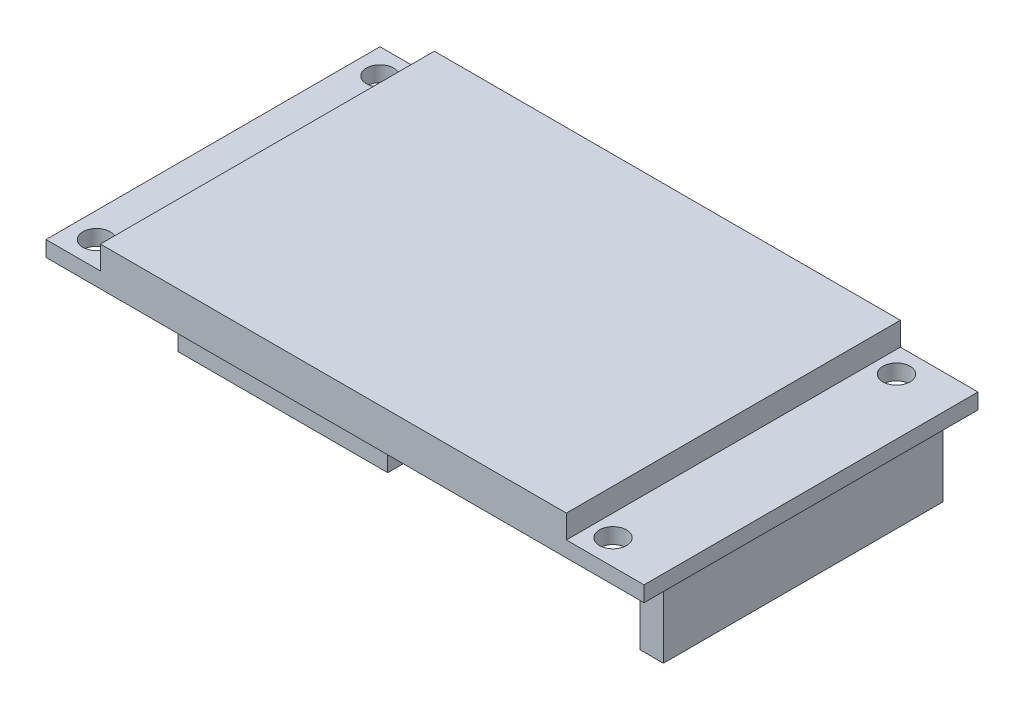
ISO-10303-21;
HEADER;
FILE_DESCRIPTION(('STEP AP214'),'2;1');
FILE_NAME('part.step','',(''),(''),'','','');
FILE_SCHEMA(('AUTOMOTIVE_DESIGN { 1 0 10303 214 1 1 1 1 }'));
ENDSEC;
DATA;
#1=APPLICATION_CONTEXT('core data for automotive mechanical design processes');
#2=APPLICATION_PROTOCOL_DEFINITION('international standard','automotive_design',2000,#1);
#3=PRODUCT_CONTEXT('',#1,'mechanical');
#4=PRODUCT('Part','Part','',(#3));
#5=PRODUCT_RELATED_PRODUCT_CATEGORY('part','',(#4));
#6=PRODUCT_DEFINITION_FORMATION('','',#4);
#7=PRODUCT_DEFINITION_CONTEXT('part definition',#1,'design');
#8=PRODUCT_DEFINITION('design','',#6,#7);
#9=PRODUCT_DEFINITION_SHAPE('','',#8);
#10=(LENGTH_UNIT() NAMED_UNIT(*) SI_UNIT(.MILLI.,.METRE.));
#11=(NAMED_UNIT(*) PLANE_ANGLE_UNIT() SI_UNIT($,.RADIAN.));
#12=(NAMED_UNIT(*) SI_UNIT($,.STERADIAN.) SOLID_ANGLE_UNIT());
#13=UNCERTAINTY_MEASURE_WITH_UNIT(LENGTH_MEASURE(1.E-05),#10,'distance_accuracy_value','');
#14=(GEOMETRIC_REPRESENTATION_CONTEXT(3) GLOBAL_UNCERTAINTY_ASSIGNED_CONTEXT((#13)) GLOBAL_UNIT_ASSIGNED_CONTEXT((#10,
#11,#12)) REPRESENTATION_CONTEXT('',''));
#15=CARTESIAN_POINT('',(0.,0.,0.));
#16=DIRECTION('',(0.,0.,1.));
#17=DIRECTION('',(1.,0.,0.));
#18=AXIS2_PLACEMENT_3D('',#15,#16,#17);
#19=CARTESIAN_POINT('',(0.,0.,0.));
#20=DIRECTION('',(0.,1.,0.));
#21=DIRECTION('',(0.,0.,1.));
#22=AXIS2_PLACEMENT_3D('',#19,#20,#21);
#23=PLANE('',#22);
#24=DIRECTION('',(0.,0.,1.));
#25=VECTOR('',#24,1.);
#26=CARTESIAN_POINT('',(37.5,0.,18.));
#27=LINE('',#26,#25);
#28=CARTESIAN_POINT('',(37.5,0.,-18.));
#29=VERTEX_POINT('',#28);
#30=CARTESIAN_POINT('',(37.5,0.,18.));
#31=VERTEX_POINT('',#30);
#32=EDGE_CURVE('E173',#29,#31,#27,.T.);
#33=ORIENTED_EDGE('',*,*,#32,.F.);
#34=DIRECTION('',(1.,0.,0.));
#35=VECTOR('',#34,1.);
#36=CARTESIAN_POINT('',(34.5,0.,-18.));
#37=LINE('',#36,#35);
#38=CARTESIAN_POINT('',(34.5,0.,-18.));
#39=VERTEX_POINT('',#38);
#40=EDGE_CURVE('E186',#39,#29,#37,.T.);
#41=ORIENTED_EDGE('',*,*,#40,.F.);
#42=DIRECTION('',(0.,0.,-1.));
#43=VECTOR('',#42,1.);
#44=CARTESIAN_POINT('',(34.5,0.,18.));
#45=LINE('',#44,#43);
#46=CARTESIAN_POINT('',(34.5,0.,18.));
#47=VERTEX_POINT('',#46);
#48=EDGE_CURVE('E195',#47,#39,#45,.T.);
#49=ORIENTED_EDGE('',*,*,#48,.F.);
#50=DIRECTION('',(-1.,0.,0.));
#51=VECTOR('',#50,1.);
#52=CARTESIAN_POINT('',(34.5,0.,18.));
#53=LINE('',#52,#51);
#54=EDGE_CURVE('E176',#31,#47,#53,.T.);
#55=ORIENTED_EDGE('',*,*,#54,.F.);
#56=EDGE_LOOP('',(#33,#41,#49,#55));
#57=FACE_BOUND('',#56,.T.);
#58=CARTESIAN_POINT('',(-35.25,0.,18.25));
#59=DIRECTION('',(0.,1.,0.));
#60=DIRECTION('',(0.,0.,1.));
#61=AXIS2_PLACEMENT_3D('',#58,#59,#60);
#62=CIRCLE('',#61,1.75);
#63=CARTESIAN_POINT('',(-35.25,0.,20.));
#64=VERTEX_POINT('',#63);
#65=EDGE_CURVE('E212',#64,#64,#62,.T.);
#66=ORIENTED_EDGE('',*,*,#65,.T.);
#67=EDGE_LOOP('',(#66));
#68=FACE_BOUND('',#67,.T.);
#69=CARTESIAN_POINT('',(-35.25,0.,-18.25));
#70=DIRECTION('',(0.,1.,0.));
#71=DIRECTION('',(0.,0.,1.));
#72=AXIS2_PLACEMENT_3D('',#69,#70,#71);
#73=CIRCLE('',#72,1.75);
#74=CARTESIAN_POINT('',(-35.25,0.,-16.5));
#75=VERTEX_POINT('',#74);
#76=EDGE_CURVE('E218',#75,#75,#73,.T.);
#77=ORIENTED_EDGE('',*,*,#76,.T.);
#78=EDGE_LOOP('',(#77));
#79=FACE_BOUND('',#78,.T.);
#80=CARTESIAN_POINT('',(31.25,0.,18.25));
#81=DIRECTION('',(0.,1.,0.));
#82=DIRECTION('',(0.,0.,1.));
#83=AXIS2_PLACEMENT_3D('',#80,#81,#82);
#84=CIRCLE('',#83,1.75);
#85=CARTESIAN_POINT('',(31.25,0.,20.));
#86=VERTEX_POINT('',#85);
#87=EDGE_CURVE('E224',#86,#86,#84,.T.);
#88=ORIENTED_EDGE('',*,*,#87,.T.);
#89=EDGE_LOOP('',(#88));
#90=FACE_BOUND('',#89,.T.);
#91=CARTESIAN_POINT('',(31.25,0.,-18.25));
#92=DIRECTION('',(0.,1.,0.));
#93=DIRECTION('',(0.,0.,1.));
#94=AXIS2_PLACEMENT_3D('',#91,#92,#93);
#95=CIRCLE('',#94,1.75);
#96=CARTESIAN_POINT('',(31.25,0.,-16.5));
#97=VERTEX_POINT('',#96);
#98=EDGE_CURVE('E230',#97,#97,#95,.T.);
#99=ORIENTED_EDGE('',*,*,#98,.T.);
#100=EDGE_LOOP('',(#99));
#101=FACE_BOUND('',#100,.T.);
#102=DIRECTION('',(1.,0.,0.));
#103=VECTOR('',#102,1.);
#104=CARTESIAN_POINT('',(0.,0.,-21.5));
#105=LINE('',#104,#103);
#106=CARTESIAN_POINT('',(-38.5,0.,-21.5));
#107=VERTEX_POINT('',#106);
#108=CARTESIAN_POINT('',(38.5,0.,-21.5));
#109=VERTEX_POINT('',#108);
#110=EDGE_CURVE('E315',#107,#109,#105,.T.);
#111=ORIENTED_EDGE('',*,*,#110,.T.);
#112=DIRECTION('',(0.,0.,1.));
#113=VECTOR('',#112,1.);
#114=CARTESIAN_POINT('',(38.5,0.,0.));
#115=LINE('',#114,#113);
#116=CARTESIAN_POINT('',(38.5,0.,21.5));
#117=VERTEX_POINT('',#116);
#118=EDGE_CURVE('E307',#109,#117,#115,.T.);
#119=ORIENTED_EDGE('',*,*,#118,.T.);
#120=DIRECTION('',(1.,0.,0.));
#121=VECTOR('',#120,1.);
#122=CARTESIAN_POINT('',(0.,0.,21.5));
#123=LINE('',#122,#121);
#124=CARTESIAN_POINT('',(-38.5,0.,21.5));
#125=VERTEX_POINT('',#124);
#126=EDGE_CURVE('E320',#125,#117,#123,.T.);
#127=ORIENTED_EDGE('',*,*,#126,.F.);
#128=DIRECTION('',(0.,0.,1.));
#129=VECTOR('',#128,1.);
#130=CARTESIAN_POINT('',(-38.5,0.,0.));
#131=LINE('',#130,#129);
#132=EDGE_CURVE('E233',#107,#125,#131,.T.);
#133=ORIENTED_EDGE('',*,*,#132,.F.);
#134=EDGE_LOOP('',(#111,#119,#127,#133));
#135=FACE_BOUND('',#134,.T.);
#136=DIRECTION('',(0.,0.,1.));
#137=VECTOR('',#136,1.);
#138=CARTESIAN_POINT('',(4.49999999999999,0.,20.5));
#139=LINE('',#138,#137);
#140=CARTESIAN_POINT('',(4.49999999999999,0.,2.5));
#141=VERTEX_POINT('',#140);
#142=CARTESIAN_POINT('',(4.49999999999999,0.,20.5));
#143=VERTEX_POINT('',#142);
#144=EDGE_CURVE('E172',#141,#143,#139,.T.);
#145=ORIENTED_EDGE('',*,*,#144,.F.);
#146=DIRECTION('',(1.,0.,0.));
#147=VECTOR('',#146,1.);
#148=CARTESIAN_POINT('',(-22.5,0.,2.5));
#149=LINE('',#148,#147);
#150=CARTESIAN_POINT('',(-22.5,0.,2.5));
#151=VERTEX_POINT('',#150);
#152=EDGE_CURVE('E169',#151,#141,#149,.T.);
#153=ORIENTED_EDGE('',*,*,#152,.F.);
#154=DIRECTION('',(0.,0.,-1.));
#155=VECTOR('',#154,1.);
#156=CARTESIAN_POINT('',(-22.5,0.,20.5));
#157=LINE('',#156,#155);
#158=CARTESIAN_POINT('',(-22.5,0.,20.5));
#159=VERTEX_POINT('',#158);
#160=EDGE_CURVE('E59',#159,#151,#157,.T.);
#161=ORIENTED_EDGE('',*,*,#160,.F.);
#162=DIRECTION('',(-1.,0.,0.));
#163=VECTOR('',#162,1.);
#164=CARTESIAN_POINT('',(-22.5,0.,20.5));
#165=LINE('',#164,#163);
#166=EDGE_CURVE('E54',#143,#159,#165,.T.);
#167=ORIENTED_EDGE('',*,*,#166,.F.);
#168=EDGE_LOOP('',(#145,#153,#161,#167));
#169=FACE_BOUND('',#168,.T.);
#170=ADVANCED_FACE('F37',(#57,#68,#79,#90,#101,#135,#169),#23,.F.);
#171=CARTESIAN_POINT('',(28.5,5.,0.));
#172=DIRECTION('',(1.,0.,0.));
#173=DIRECTION('',(0.,0.,-1.));
#174=AXIS2_PLACEMENT_3D('',#171,#172,#173);
#175=PLANE('',#174);
#176=DIRECTION('',(0.,0.,1.));
#177=VECTOR('',#176,1.);
#178=CARTESIAN_POINT('',(28.5,2.,0.));
#179=LINE('',#178,#177);
#180=CARTESIAN_POINT('',(28.5,2.,-21.5));
#181=VERTEX_POINT('',#180);
#182=CARTESIAN_POINT('',(28.5,2.,21.5));
#183=VERTEX_POINT('',#182);
#184=EDGE_CURVE('E293',#181,#183,#179,.T.);
#185=ORIENTED_EDGE('',*,*,#184,.F.);
#186=DIRECTION('',(0.,-1.,0.));
#187=VECTOR('',#186,1.);
#188=CARTESIAN_POINT('',(28.5,5.,-21.5));
#189=LINE('',#188,#187);
#190=CARTESIAN_POINT('',(28.5,5.,-21.5));
#191=VERTEX_POINT('',#190);
#192=EDGE_CURVE('E11',#191,#181,#189,.T.);
#193=ORIENTED_EDGE('',*,*,#192,.F.);
#194=DIRECTION('',(0.,0.,1.));
#195=VECTOR('',#194,1.);
#196=CARTESIAN_POINT('',(28.5,5.,0.));
#197=LINE('',#196,#195);
#198=CARTESIAN_POINT('',(28.5,5.,21.5));
#199=VERTEX_POINT('',#198);
#200=EDGE_CURVE('E316',#191,#199,#197,.T.);
#201=ORIENTED_EDGE('',*,*,#200,.T.);
#202=DIRECTION('',(0.,-1.,0.));
#203=VECTOR('',#202,1.);
#204=CARTESIAN_POINT('',(28.5,5.,21.5));
#205=LINE('',#204,#203);
#206=EDGE_CURVE('E279',#199,#183,#205,.T.);
#207=ORIENTED_EDGE('',*,*,#206,.T.);
#208=EDGE_LOOP('',(#185,#193,#201,#207));
#209=FACE_BOUND('',#208,.T.);
#210=ADVANCED_FACE('F39',(#209),#175,.T.);
#211=CARTESIAN_POINT('',(0.,5.,-21.5));
#212=DIRECTION('',(0.,0.,-1.));
#213=DIRECTION('',(-1.,0.,0.));
#214=AXIS2_PLACEMENT_3D('',#211,#212,#213);
#215=PLANE('',#214);
#216=ORIENTED_EDGE('',*,*,#110,.F.);
#217=DIRECTION('',(0.,-1.,0.));
#218=VECTOR('',#217,1.);
#219=CARTESIAN_POINT('',(-38.5,2.,-21.5));
#220=LINE('',#219,#218);
#221=CARTESIAN_POINT('',(-38.5,2.,-21.5));
#222=VERTEX_POINT('',#221);
#223=EDGE_CURVE('E268',#222,#107,#220,.T.);
#224=ORIENTED_EDGE('',*,*,#223,.F.);
#225=DIRECTION('',(1.,0.,0.));
#226=VECTOR('',#225,1.);
#227=CARTESIAN_POINT('',(0.,2.,-21.5));
#228=LINE('',#227,#226);
#229=CARTESIAN_POINT('',(-31.5,2.,-21.5));
#230=VERTEX_POINT('',#229);
#231=EDGE_CURVE('E245',#222,#230,#228,.T.);
#232=ORIENTED_EDGE('',*,*,#231,.T.);
#233=DIRECTION('',(0.,-1.,0.));
#234=VECTOR('',#233,1.);
#235=CARTESIAN_POINT('',(-31.5,5.,-21.5));
#236=LINE('',#235,#234);
#237=CARTESIAN_POINT('',(-31.5,5.,-21.5));
#238=VERTEX_POINT('',#237);
#239=EDGE_CURVE('E46',#238,#230,#236,.T.);
#240=ORIENTED_EDGE('',*,*,#239,.F.);
#241=DIRECTION('',(1.,0.,0.));
#242=VECTOR('',#241,1.);
#243=CARTESIAN_POINT('',(0.,5.,-21.5));
#244=LINE('',#243,#242);
#245=EDGE_CURVE('E319',#238,#191,#244,.T.);
#246=ORIENTED_EDGE('',*,*,#245,.T.);
#247=ORIENTED_EDGE('',*,*,#192,.T.);
#248=DIRECTION('',(1.,0.,0.));
#249=VECTOR('',#248,1.);
#250=CARTESIAN_POINT('',(0.,2.,-21.5));
#251=LINE('',#250,#249);
#252=CARTESIAN_POINT('',(38.5,2.,-21.5));
#253=VERTEX_POINT('',#252);
#254=EDGE_CURVE('E298',#181,#253,#251,.T.);
#255=ORIENTED_EDGE('',*,*,#254,.T.);
#256=DIRECTION('',(0.,-1.,0.));
#257=VECTOR('',#256,1.);
#258=CARTESIAN_POINT('',(38.5,2.,-21.5));
#259=LINE('',#258,#257);
#260=EDGE_CURVE('E306',#253,#109,#259,.T.);
#261=ORIENTED_EDGE('',*,*,#260,.T.);
#262=EDGE_LOOP('',(#216,#224,#232,#240,#246,#247,#255,#261));
#263=FACE_BOUND('',#262,.T.);
#264=ADVANCED_FACE('F334',(#263),#215,.T.);
#265=CARTESIAN_POINT('',(-31.5,5.,0.));
#266=DIRECTION('',(1.,0.,0.));
#267=DIRECTION('',(0.,0.,-1.));
#268=AXIS2_PLACEMENT_3D('',#265,#266,#267);
#269=PLANE('',#268);
#270=ORIENTED_EDGE('',*,*,#239,.T.);
#271=DIRECTION('',(0.,0.,1.));
#272=VECTOR('',#271,1.);
#273=CARTESIAN_POINT('',(-31.5,2.,0.));
#274=LINE('',#273,#272);
#275=CARTESIAN_POINT('',(-31.5,2.,21.5));
#276=VERTEX_POINT('',#275);
#277=EDGE_CURVE('E241',#230,#276,#274,.T.);
#278=ORIENTED_EDGE('',*,*,#277,.T.);
#279=DIRECTION('',(0.,-1.,0.));
#280=VECTOR('',#279,1.);
#281=CARTESIAN_POINT('',(-31.5,5.,21.5));
#282=LINE('',#281,#280);
#283=CARTESIAN_POINT('',(-31.5,5.,21.5));
#284=VERTEX_POINT('',#283);
#285=EDGE_CURVE('E274',#284,#276,#282,.T.);
#286=ORIENTED_EDGE('',*,*,#285,.F.);
#287=DIRECTION('',(0.,0.,1.));
#288=VECTOR('',#287,1.);
#289=CARTESIAN_POINT('',(-31.5,5.,0.));
#290=LINE('',#289,#288);
#291=EDGE_CURVE('E323',#238,#284,#290,.T.);
#292=ORIENTED_EDGE('',*,*,#291,.F.);
#293=EDGE_LOOP('',(#270,#278,#286,#292));
#294=FACE_BOUND('',#293,.T.);
#295=ADVANCED_FACE('F343',(#294),#269,.F.);
#296=CARTESIAN_POINT('',(0.,5.,21.5));
#297=DIRECTION('',(0.,0.,-1.));
#298=DIRECTION('',(-1.,0.,0.));
#299=AXIS2_PLACEMENT_3D('',#296,#297,#298);
#300=PLANE('',#299);
#301=ORIENTED_EDGE('',*,*,#126,.T.);
#302=DIRECTION('',(0.,-1.,0.));
#303=VECTOR('',#302,1.);
#304=CARTESIAN_POINT('',(38.5,2.,21.5));
#305=LINE('',#304,#303);
#306=CARTESIAN_POINT('',(38.5,2.,21.5));
#307=VERTEX_POINT('',#306);
#308=EDGE_CURVE('E312',#307,#117,#305,.T.);
#309=ORIENTED_EDGE('',*,*,#308,.F.);
#310=DIRECTION('',(1.,0.,0.));
#311=VECTOR('',#310,1.);
#312=CARTESIAN_POINT('',(0.,2.,21.5));
#313=LINE('',#312,#311);
#314=EDGE_CURVE('E297',#183,#307,#313,.T.);
#315=ORIENTED_EDGE('',*,*,#314,.F.);
#316=ORIENTED_EDGE('',*,*,#206,.F.);
#317=DIRECTION('',(1.,0.,0.));
#318=VECTOR('',#317,1.);
#319=CARTESIAN_POINT('',(0.,5.,21.5));
#320=LINE('',#319,#318);
#321=EDGE_CURVE('E276',#284,#199,#320,.T.);
#322=ORIENTED_EDGE('',*,*,#321,.F.);
#323=ORIENTED_EDGE('',*,*,#285,.T.);
#324=DIRECTION('',(1.,0.,0.));
#325=VECTOR('',#324,1.);
#326=CARTESIAN_POINT('',(0.,2.,21.5));
#327=LINE('',#326,#325);
#328=CARTESIAN_POINT('',(-38.5,2.,21.5));
#329=VERTEX_POINT('',#328);
#330=EDGE_CURVE('E248',#329,#276,#327,.T.);
#331=ORIENTED_EDGE('',*,*,#330,.F.);
#332=DIRECTION('',(0.,-1.,0.));
#333=VECTOR('',#332,1.);
#334=CARTESIAN_POINT('',(-38.5,2.,21.5));
#335=LINE('',#334,#333);
#336=EDGE_CURVE('E250',#329,#125,#335,.T.);
#337=ORIENTED_EDGE('',*,*,#336,.T.);
#338=EDGE_LOOP('',(#301,#309,#315,#316,#322,#323,#331,#337));
#339=FACE_BOUND('',#338,.T.);
#340=ADVANCED_FACE('F271',(#339),#300,.F.);
#341=CARTESIAN_POINT('',(0.,5.,0.));
#342=DIRECTION('',(0.,1.,0.));
#343=DIRECTION('',(0.,0.,1.));
#344=AXIS2_PLACEMENT_3D('',#341,#342,#343);
#345=PLANE('',#344);
#346=ORIENTED_EDGE('',*,*,#200,.F.);
#347=ORIENTED_EDGE('',*,*,#245,.F.);
#348=ORIENTED_EDGE('',*,*,#291,.T.);
#349=ORIENTED_EDGE('',*,*,#321,.T.);
#350=EDGE_LOOP('',(#346,#347,#348,#349));
#351=FACE_BOUND('',#350,.T.);
#352=ADVANCED_FACE('F342',(#351),#345,.T.);
#353=CARTESIAN_POINT('',(38.5,2.,0.));
#354=DIRECTION('',(1.,0.,0.));
#355=DIRECTION('',(0.,0.,-1.));
#356=AXIS2_PLACEMENT_3D('',#353,#354,#355);
#357=PLANE('',#356);
#358=ORIENTED_EDGE('',*,*,#118,.F.);
#359=ORIENTED_EDGE('',*,*,#260,.F.);
#360=DIRECTION('',(0.,0.,1.));
#361=VECTOR('',#360,1.);
#362=CARTESIAN_POINT('',(38.5,2.,0.));
#363=LINE('',#362,#361);
#364=EDGE_CURVE('E303',#253,#307,#363,.T.);
#365=ORIENTED_EDGE('',*,*,#364,.T.);
#366=ORIENTED_EDGE('',*,*,#308,.T.);
#367=EDGE_LOOP('',(#358,#359,#365,#366));
#368=FACE_BOUND('',#367,.T.);
#369=ADVANCED_FACE('F331',(#368),#357,.T.);
#370=CARTESIAN_POINT('',(0.,2.,0.));
#371=DIRECTION('',(0.,1.,0.));
#372=DIRECTION('',(0.,0.,1.));
#373=AXIS2_PLACEMENT_3D('',#370,#371,#372);
#374=PLANE('',#373);
#375=CARTESIAN_POINT('',(31.25,2.,18.25));
#376=DIRECTION('',(0.,1.,0.));
#377=DIRECTION('',(0.,0.,1.));
#378=AXIS2_PLACEMENT_3D('',#375,#376,#377);
#379=CIRCLE('',#378,1.75);
#380=CARTESIAN_POINT('',(31.25,2.,20.));
#381=VERTEX_POINT('',#380);
#382=EDGE_CURVE('E221',#381,#381,#379,.T.);
#383=ORIENTED_EDGE('',*,*,#382,.F.);
#384=EDGE_LOOP('',(#383));
#385=FACE_BOUND('',#384,.T.);
#386=CARTESIAN_POINT('',(31.25,2.,-18.25));
#387=DIRECTION('',(0.,1.,0.));
#388=DIRECTION('',(0.,0.,1.));
#389=AXIS2_PLACEMENT_3D('',#386,#387,#388);
#390=CIRCLE('',#389,1.75);
#391=CARTESIAN_POINT('',(31.25,2.,-16.5));
#392=VERTEX_POINT('',#391);
#393=EDGE_CURVE('E227',#392,#392,#390,.T.);
#394=ORIENTED_EDGE('',*,*,#393,.F.);
#395=EDGE_LOOP('',(#394));
#396=FACE_BOUND('',#395,.T.);
#397=ORIENTED_EDGE('',*,*,#254,.F.);
#398=ORIENTED_EDGE('',*,*,#184,.T.);
#399=ORIENTED_EDGE('',*,*,#314,.T.);
#400=ORIENTED_EDGE('',*,*,#364,.F.);
#401=EDGE_LOOP('',(#397,#398,#399,#400));
#402=FACE_BOUND('',#401,.T.);
#403=ADVANCED_FACE('F337',(#385,#396,#402),#374,.T.);
#404=CARTESIAN_POINT('',(-38.5,2.,0.));
#405=DIRECTION('',(1.,0.,0.));
#406=DIRECTION('',(0.,0.,-1.));
#407=AXIS2_PLACEMENT_3D('',#404,#405,#406);
#408=PLANE('',#407);
#409=ORIENTED_EDGE('',*,*,#132,.T.);
#410=ORIENTED_EDGE('',*,*,#336,.F.);
#411=DIRECTION('',(0.,0.,1.));
#412=VECTOR('',#411,1.);
#413=CARTESIAN_POINT('',(-38.5,2.,0.));
#414=LINE('',#413,#412);
#415=EDGE_CURVE('E238',#222,#329,#414,.T.);
#416=ORIENTED_EDGE('',*,*,#415,.F.);
#417=ORIENTED_EDGE('',*,*,#223,.T.);
#418=EDGE_LOOP('',(#409,#410,#416,#417));
#419=FACE_BOUND('',#418,.T.);
#420=ADVANCED_FACE('F265',(#419),#408,.F.);
#421=CARTESIAN_POINT('',(0.,2.,0.));
#422=DIRECTION('',(0.,1.,0.));
#423=DIRECTION('',(0.,0.,1.));
#424=AXIS2_PLACEMENT_3D('',#421,#422,#423);
#425=PLANE('',#424);
#426=CARTESIAN_POINT('',(-35.25,2.,18.25));
#427=DIRECTION('',(0.,1.,0.));
#428=DIRECTION('',(0.,0.,1.));
#429=AXIS2_PLACEMENT_3D('',#426,#427,#428);
#430=CIRCLE('',#429,1.75);
#431=CARTESIAN_POINT('',(-35.25,2.,20.));
#432=VERTEX_POINT('',#431);
#433=EDGE_CURVE('E211',#432,#432,#430,.T.);
#434=ORIENTED_EDGE('',*,*,#433,.F.);
#435=EDGE_LOOP('',(#434));
#436=FACE_BOUND('',#435,.T.);
#437=CARTESIAN_POINT('',(-35.25,2.,-18.25));
#438=DIRECTION('',(0.,1.,0.));
#439=DIRECTION('',(0.,0.,1.));
#440=AXIS2_PLACEMENT_3D('',#437,#438,#439);
#441=CIRCLE('',#440,1.75);
#442=CARTESIAN_POINT('',(-35.25,2.,-16.5));
#443=VERTEX_POINT('',#442);
#444=EDGE_CURVE('E215',#443,#443,#441,.T.);
#445=ORIENTED_EDGE('',*,*,#444,.F.);
#446=EDGE_LOOP('',(#445));
#447=FACE_BOUND('',#446,.T.);
#448=ORIENTED_EDGE('',*,*,#277,.F.);
#449=ORIENTED_EDGE('',*,*,#231,.F.);
#450=ORIENTED_EDGE('',*,*,#415,.T.);
#451=ORIENTED_EDGE('',*,*,#330,.T.);
#452=EDGE_LOOP('',(#448,#449,#450,#451));
#453=FACE_BOUND('',#452,.T.);
#454=ADVANCED_FACE('F259',(#436,#447,#453),#425,.T.);
#455=CARTESIAN_POINT('',(31.25,0.,-18.25));
#456=DIRECTION('',(0.,1.,0.));
#457=DIRECTION('',(0.,0.,1.));
#458=AXIS2_PLACEMENT_3D('',#455,#456,#457);
#459=CYLINDRICAL_SURFACE('',#458,1.75);
#460=ORIENTED_EDGE('',*,*,#98,.F.);
#461=EDGE_LOOP('',(#460));
#462=FACE_BOUND('',#461,.T.);
#463=ORIENTED_EDGE('',*,*,#393,.T.);
#464=EDGE_LOOP('',(#463));
#465=FACE_BOUND('',#464,.T.);
#466=ADVANCED_FACE('F370',(#462,#465),#459,.F.);
#467=CARTESIAN_POINT('',(31.25,0.,18.25));
#468=DIRECTION('',(0.,1.,0.));
#469=DIRECTION('',(0.,0.,1.));
#470=AXIS2_PLACEMENT_3D('',#467,#468,#469);
#471=CYLINDRICAL_SURFACE('',#470,1.75);
#472=ORIENTED_EDGE('',*,*,#87,.F.);
#473=EDGE_LOOP('',(#472));
#474=FACE_BOUND('',#473,.T.);
#475=ORIENTED_EDGE('',*,*,#382,.T.);
#476=EDGE_LOOP('',(#475));
#477=FACE_BOUND('',#476,.T.);
#478=ADVANCED_FACE('F374',(#474,#477),#471,.F.);
#479=CARTESIAN_POINT('',(-35.25,0.,-18.25));
#480=DIRECTION('',(0.,1.,0.));
#481=DIRECTION('',(0.,0.,1.));
#482=AXIS2_PLACEMENT_3D('',#479,#480,#481);
#483=CYLINDRICAL_SURFACE('',#482,1.75);
#484=ORIENTED_EDGE('',*,*,#76,.F.);
#485=EDGE_LOOP('',(#484));
#486=FACE_BOUND('',#485,.T.);
#487=ORIENTED_EDGE('',*,*,#444,.T.);
#488=EDGE_LOOP('',(#487));
#489=FACE_BOUND('',#488,.T.);
#490=ADVANCED_FACE('F378',(#486,#489),#483,.F.);
#491=CARTESIAN_POINT('',(-35.25,0.,18.25));
#492=DIRECTION('',(0.,1.,0.));
#493=DIRECTION('',(0.,0.,1.));
#494=AXIS2_PLACEMENT_3D('',#491,#492,#493);
#495=CYLINDRICAL_SURFACE('',#494,1.75);
#496=ORIENTED_EDGE('',*,*,#65,.F.);
#497=EDGE_LOOP('',(#496));
#498=FACE_BOUND('',#497,.T.);
#499=ORIENTED_EDGE('',*,*,#433,.T.);
#500=EDGE_LOOP('',(#499));
#501=FACE_BOUND('',#500,.T.);
#502=ADVANCED_FACE('F382',(#498,#501),#495,.F.);
#503=CARTESIAN_POINT('',(37.5,-9.,18.));
#504=DIRECTION('',(-1.,0.,0.));
#505=DIRECTION('',(0.,0.,1.));
#506=AXIS2_PLACEMENT_3D('',#503,#504,#505);
#507=PLANE('',#506);
#508=ORIENTED_EDGE('',*,*,#32,.T.);
#509=DIRECTION('',(0.,1.,0.));
#510=VECTOR('',#509,1.);
#511=CARTESIAN_POINT('',(37.5,-9.,18.));
#512=LINE('',#511,#510);
#513=CARTESIAN_POINT('',(37.5,-9.,18.));
#514=VERTEX_POINT('',#513);
#515=EDGE_CURVE('E208',#514,#31,#512,.T.);
#516=ORIENTED_EDGE('',*,*,#515,.F.);
#517=DIRECTION('',(0.,0.,1.));
#518=VECTOR('',#517,1.);
#519=CARTESIAN_POINT('',(37.5,-9.,18.));
#520=LINE('',#519,#518);
#521=CARTESIAN_POINT('',(37.5,-9.,-18.));
#522=VERTEX_POINT('',#521);
#523=EDGE_CURVE('E182',#522,#514,#520,.T.);
#524=ORIENTED_EDGE('',*,*,#523,.F.);
#525=DIRECTION('',(0.,1.,0.));
#526=VECTOR('',#525,1.);
#527=CARTESIAN_POINT('',(37.5,-9.,-18.));
#528=LINE('',#527,#526);
#529=EDGE_CURVE('E191',#522,#29,#528,.T.);
#530=ORIENTED_EDGE('',*,*,#529,.T.);
#531=EDGE_LOOP('',(#508,#516,#524,#530));
#532=FACE_BOUND('',#531,.T.);
#533=ADVANCED_FACE('F386',(#532),#507,.F.);
#534=CARTESIAN_POINT('',(34.5,-9.,18.));
#535=DIRECTION('',(0.,0.,-1.));
#536=DIRECTION('',(-1.,0.,0.));
#537=AXIS2_PLACEMENT_3D('',#534,#535,#536);
#538=PLANE('',#537);
#539=ORIENTED_EDGE('',*,*,#54,.T.);
#540=DIRECTION('',(0.,1.,0.));
#541=VECTOR('',#540,1.);
#542=CARTESIAN_POINT('',(34.5,-9.,18.));
#543=LINE('',#542,#541);
#544=CARTESIAN_POINT('',(34.5,-9.,18.));
#545=VERTEX_POINT('',#544);
#546=EDGE_CURVE('E205',#545,#47,#543,.T.);
#547=ORIENTED_EDGE('',*,*,#546,.F.);
#548=DIRECTION('',(-1.,0.,0.));
#549=VECTOR('',#548,1.);
#550=CARTESIAN_POINT('',(34.5,-9.,18.));
#551=LINE('',#550,#549);
#552=EDGE_CURVE('E185',#514,#545,#551,.T.);
#553=ORIENTED_EDGE('',*,*,#552,.F.);
#554=ORIENTED_EDGE('',*,*,#515,.T.);
#555=EDGE_LOOP('',(#539,#547,#553,#554));
#556=FACE_BOUND('',#555,.T.);
#557=ADVANCED_FACE('F390',(#556),#538,.F.);
#558=CARTESIAN_POINT('',(34.5,-9.,18.));
#559=DIRECTION('',(1.,0.,0.));
#560=DIRECTION('',(0.,0.,-1.));
#561=AXIS2_PLACEMENT_3D('',#558,#559,#560);
#562=PLANE('',#561);
#563=ORIENTED_EDGE('',*,*,#48,.T.);
#564=DIRECTION('',(0.,1.,0.));
#565=VECTOR('',#564,1.);
#566=CARTESIAN_POINT('',(34.5,-9.,-18.));
#567=LINE('',#566,#565);
#568=CARTESIAN_POINT('',(34.5,-9.,-18.));
#569=VERTEX_POINT('',#568);
#570=EDGE_CURVE('E202',#569,#39,#567,.T.);
#571=ORIENTED_EDGE('',*,*,#570,.F.);
#572=DIRECTION('',(0.,0.,-1.));
#573=VECTOR('',#572,1.);
#574=CARTESIAN_POINT('',(34.5,-9.,18.));
#575=LINE('',#574,#573);
#576=EDGE_CURVE('E188',#545,#569,#575,.T.);
#577=ORIENTED_EDGE('',*,*,#576,.F.);
#578=ORIENTED_EDGE('',*,*,#546,.T.);
#579=EDGE_LOOP('',(#563,#571,#577,#578));
#580=FACE_BOUND('',#579,.T.);
#581=ADVANCED_FACE('F394',(#580),#562,.F.);
#582=CARTESIAN_POINT('',(34.5,-9.,-18.));
#583=DIRECTION('',(0.,0.,1.));
#584=DIRECTION('',(1.,0.,0.));
#585=AXIS2_PLACEMENT_3D('',#582,#583,#584);
#586=PLANE('',#585);
#587=ORIENTED_EDGE('',*,*,#40,.T.);
#588=ORIENTED_EDGE('',*,*,#529,.F.);
#589=DIRECTION('',(1.,0.,0.));
#590=VECTOR('',#589,1.);
#591=CARTESIAN_POINT('',(34.5,-9.,-18.));
#592=LINE('',#591,#590);
#593=EDGE_CURVE('E190',#569,#522,#592,.T.);
#594=ORIENTED_EDGE('',*,*,#593,.F.);
#595=ORIENTED_EDGE('',*,*,#570,.T.);
#596=EDGE_LOOP('',(#587,#588,#594,#595));
#597=FACE_BOUND('',#596,.T.);
#598=ADVANCED_FACE('F398',(#597),#586,.F.);
#599=CARTESIAN_POINT('',(0.,-9.,0.));
#600=DIRECTION('',(0.,-1.,0.));
#601=DIRECTION('',(0.,0.,-1.));
#602=AXIS2_PLACEMENT_3D('',#599,#600,#601);
#603=PLANE('',#602);
#604=ORIENTED_EDGE('',*,*,#523,.T.);
#605=ORIENTED_EDGE('',*,*,#552,.T.);
#606=ORIENTED_EDGE('',*,*,#576,.T.);
#607=ORIENTED_EDGE('',*,*,#593,.T.);
#608=EDGE_LOOP('',(#604,#605,#606,#607));
#609=FACE_BOUND('',#608,.T.);
#610=ADVANCED_FACE('F402',(#609),#603,.T.);
#611=CARTESIAN_POINT('',(4.49999999999999,-3.,20.5));
#612=DIRECTION('',(-1.,0.,0.));
#613=DIRECTION('',(0.,0.,1.));
#614=AXIS2_PLACEMENT_3D('',#611,#612,#613);
#615=PLANE('',#614);
#616=ORIENTED_EDGE('',*,*,#144,.T.);
#617=DIRECTION('',(0.,1.,0.));
#618=VECTOR('',#617,1.);
#619=CARTESIAN_POINT('',(4.49999999999999,-3.,20.5));
#620=LINE('',#619,#618);
#621=CARTESIAN_POINT('',(4.49999999999999,-3.,20.5));
#622=VERTEX_POINT('',#621);
#623=EDGE_CURVE('E153',#622,#143,#620,.T.);
#624=ORIENTED_EDGE('',*,*,#623,.F.);
#625=DIRECTION('',(0.,0.,1.));
#626=VECTOR('',#625,1.);
#627=CARTESIAN_POINT('',(4.49999999999999,-3.,20.5));
#628=LINE('',#627,#626);
#629=CARTESIAN_POINT('',(4.49999999999999,-3.,2.5));
#630=VERTEX_POINT('',#629);
#631=EDGE_CURVE('E160',#630,#622,#628,.T.);
#632=ORIENTED_EDGE('',*,*,#631,.F.);
#633=DIRECTION('',(0.,1.,0.));
#634=VECTOR('',#633,1.);
#635=CARTESIAN_POINT('',(4.49999999999999,-3.,2.5));
#636=LINE('',#635,#634);
#637=EDGE_CURVE('E588',#630,#141,#636,.T.);
#638=ORIENTED_EDGE('',*,*,#637,.T.);
#639=EDGE_LOOP('',(#616,#624,#632,#638));
#640=FACE_BOUND('',#639,.T.);
#641=ADVANCED_FACE('F171',(#640),#615,.F.);
#642=CARTESIAN_POINT('',(-22.5,-3.,20.5));
#643=DIRECTION('',(0.,0.,-1.));
#644=DIRECTION('',(-1.,0.,0.));
#645=AXIS2_PLACEMENT_3D('',#642,#643,#644);
#646=PLANE('',#645);
#647=ORIENTED_EDGE('',*,*,#166,.T.);
#648=DIRECTION('',(0.,1.,0.));
#649=VECTOR('',#648,1.);
#650=CARTESIAN_POINT('',(-22.5,-3.,20.5));
#651=LINE('',#650,#649);
#652=CARTESIAN_POINT('',(-22.5,-3.,20.5));
#653=VERTEX_POINT('',#652);
#654=EDGE_CURVE('E156',#653,#159,#651,.T.);
#655=ORIENTED_EDGE('',*,*,#654,.F.);
#656=DIRECTION('',(-1.,0.,0.));
#657=VECTOR('',#656,1.);
#658=CARTESIAN_POINT('',(-22.5,-3.,20.5));
#659=LINE('',#658,#657);
#660=EDGE_CURVE('E149',#622,#653,#659,.T.);
#661=ORIENTED_EDGE('',*,*,#660,.F.);
#662=ORIENTED_EDGE('',*,*,#623,.T.);
#663=EDGE_LOOP('',(#647,#655,#661,#662));
#664=FACE_BOUND('',#663,.T.);
#665=ADVANCED_FACE('F151',(#664),#646,.F.);
#666=CARTESIAN_POINT('',(-22.5,-3.,20.5));
#667=DIRECTION('',(1.,0.,0.));
#668=DIRECTION('',(0.,0.,-1.));
#669=AXIS2_PLACEMENT_3D('',#666,#667,#668);
#670=PLANE('',#669);
#671=ORIENTED_EDGE('',*,*,#160,.T.);
#672=DIRECTION('',(0.,1.,0.));
#673=VECTOR('',#672,1.);
#674=CARTESIAN_POINT('',(-22.5,-3.,2.5));
#675=LINE('',#674,#673);
#676=CARTESIAN_POINT('',(-22.5,-3.,2.5));
#677=VERTEX_POINT('',#676);
#678=EDGE_CURVE('E178',#677,#151,#675,.T.);
#679=ORIENTED_EDGE('',*,*,#678,.F.);
#680=DIRECTION('',(0.,0.,-1.));
#681=VECTOR('',#680,1.);
#682=CARTESIAN_POINT('',(-22.5,-3.,20.5));
#683=LINE('',#682,#681);
#684=EDGE_CURVE('E159',#653,#677,#683,.T.);
#685=ORIENTED_EDGE('',*,*,#684,.F.);
#686=ORIENTED_EDGE('',*,*,#654,.T.);
#687=EDGE_LOOP('',(#671,#679,#685,#686));
#688=FACE_BOUND('',#687,.T.);
#689=ADVANCED_FACE('F411',(#688),#670,.F.);
#690=CARTESIAN_POINT('',(-22.5,-3.,2.5));
#691=DIRECTION('',(0.,0.,1.));
#692=DIRECTION('',(1.,0.,0.));
#693=AXIS2_PLACEMENT_3D('',#690,#691,#692);
#694=PLANE('',#693);
#695=ORIENTED_EDGE('',*,*,#152,.T.);
#696=ORIENTED_EDGE('',*,*,#637,.F.);
#697=DIRECTION('',(1.,0.,0.));
#698=VECTOR('',#697,1.);
#699=CARTESIAN_POINT('',(-22.5,-3.,2.5));
#700=LINE('',#699,#698);
#701=EDGE_CURVE('E165',#677,#630,#700,.T.);
#702=ORIENTED_EDGE('',*,*,#701,.F.);
#703=ORIENTED_EDGE('',*,*,#678,.T.);
#704=EDGE_LOOP('',(#695,#696,#702,#703));
#705=FACE_BOUND('',#704,.T.);
#706=ADVANCED_FACE('F414',(#705),#694,.F.);
#707=CARTESIAN_POINT('',(0.,-3.,0.));
#708=DIRECTION('',(0.,-1.,0.));
#709=DIRECTION('',(0.,0.,-1.));
#710=AXIS2_PLACEMENT_3D('',#707,#708,#709);
#711=PLANE('',#710);
#712=ORIENTED_EDGE('',*,*,#631,.T.);
#713=ORIENTED_EDGE('',*,*,#660,.T.);
#714=ORIENTED_EDGE('',*,*,#684,.T.);
#715=ORIENTED_EDGE('',*,*,#701,.T.);
#716=EDGE_LOOP('',(#712,#713,#714,#715));
#717=FACE_BOUND('',#716,.T.);
#718=ADVANCED_FACE('F163',(#717),#711,.T.);
#719=CLOSED_SHELL('',(#170,#210,#264,#295,#340,#352,#369,#403,#420,#454,#466,#478,#490,#502,
#533,#557,#581,#598,#610,#641,#665,#689,#706,#718));
#720=MANIFOLD_SOLID_BREP('B2',#719);
#721=ADVANCED_BREP_SHAPE_REPRESENTATION('',(#18,#720),#14);
#722=SHAPE_DEFINITION_REPRESENTATION(#9,#721);
ENDSEC;
END-ISO-10303-21;
